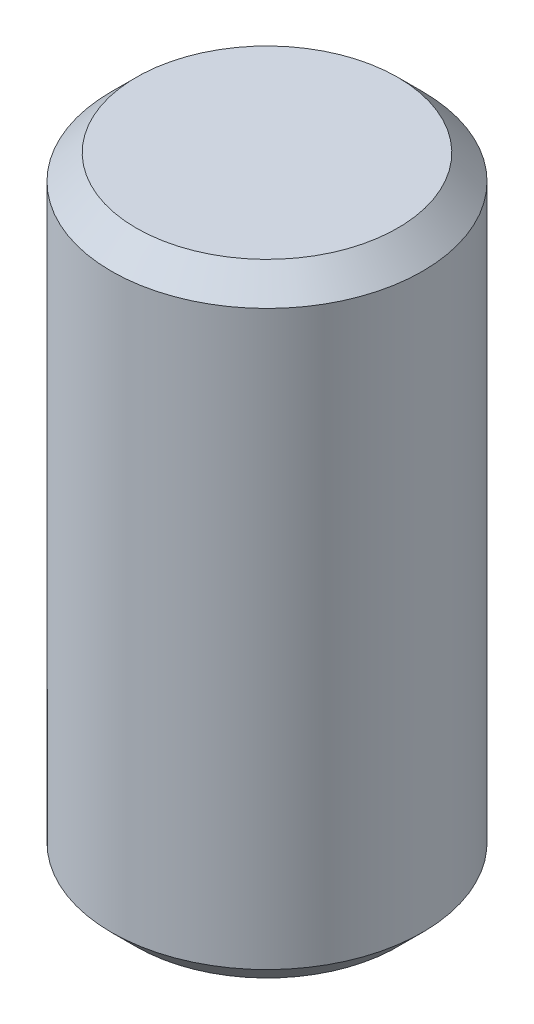
ISO-10303-21;
HEADER;
FILE_DESCRIPTION(('STEP AP214'),'2;1');
FILE_NAME('part.step','',(''),(''),'','','');
FILE_SCHEMA(('AUTOMOTIVE_DESIGN { 1 0 10303 214 1 1 1 1 }'));
ENDSEC;
DATA;
#1=APPLICATION_CONTEXT('core data for automotive mechanical design processes');
#2=APPLICATION_PROTOCOL_DEFINITION('international standard','automotive_design',2000,#1);
#3=PRODUCT_CONTEXT('',#1,'mechanical');
#4=PRODUCT('Part','Part','',(#3));
#5=PRODUCT_RELATED_PRODUCT_CATEGORY('part','',(#4));
#6=PRODUCT_DEFINITION_FORMATION('','',#4);
#7=PRODUCT_DEFINITION_CONTEXT('part definition',#1,'design');
#8=PRODUCT_DEFINITION('design','',#6,#7);
#9=PRODUCT_DEFINITION_SHAPE('','',#8);
#10=(LENGTH_UNIT() NAMED_UNIT(*) SI_UNIT(.MILLI.,.METRE.));
#11=(NAMED_UNIT(*) PLANE_ANGLE_UNIT() SI_UNIT($,.RADIAN.));
#12=(NAMED_UNIT(*) SI_UNIT($,.STERADIAN.) SOLID_ANGLE_UNIT());
#13=UNCERTAINTY_MEASURE_WITH_UNIT(LENGTH_MEASURE(1.E-05),#10,'distance_accuracy_value','');
#14=(GEOMETRIC_REPRESENTATION_CONTEXT(3) GLOBAL_UNCERTAINTY_ASSIGNED_CONTEXT((#13)) GLOBAL_UNIT_ASSIGNED_CONTEXT((#10,
#11,#12)) REPRESENTATION_CONTEXT('',''));
#15=CARTESIAN_POINT('',(0.,0.,0.));
#16=DIRECTION('',(0.,0.,1.));
#17=DIRECTION('',(1.,0.,0.));
#18=AXIS2_PLACEMENT_3D('',#15,#16,#17);
#19=CARTESIAN_POINT('',(0.,-6.35,0.));
#20=DIRECTION('',(0.,1.,0.));
#21=DIRECTION('',(0.,0.,1.));
#22=AXIS2_PLACEMENT_3D('',#19,#20,#21);
#23=PLANE('',#22);
#24=CARTESIAN_POINT('',(0.,-6.35,0.));
#25=DIRECTION('',(0.,1.,0.));
#26=DIRECTION('',(0.,0.,1.));
#27=AXIS2_PLACEMENT_3D('',#24,#25,#26);
#28=CIRCLE('',#27,2.667);
#29=CARTESIAN_POINT('',(0.,-6.35,2.667));
#30=VERTEX_POINT('',#29);
#31=EDGE_CURVE('E38',#30,#30,#28,.F.);
#32=ORIENTED_EDGE('',*,*,#31,.T.);
#33=EDGE_LOOP('',(#32));
#34=FACE_BOUND('',#33,.T.);
#35=ADVANCED_FACE('F31',(#34),#23,.F.);
#36=CARTESIAN_POINT('',(0.,6.08020788678209,0.));
#37=DIRECTION('',(0.,1.,0.));
#38=DIRECTION('',(0.,0.,1.));
#39=AXIS2_PLACEMENT_3D('',#36,#37,#38);
#40=CYLINDRICAL_SURFACE('',#39,3.175);
#41=CARTESIAN_POINT('',(0.,-5.842,0.));
#42=DIRECTION('',(0.,1.,0.));
#43=DIRECTION('',(0.,0.,1.));
#44=AXIS2_PLACEMENT_3D('',#41,#42,#43);
#45=CIRCLE('',#44,3.175);
#46=CARTESIAN_POINT('',(0.,-5.842,3.175));
#47=VERTEX_POINT('',#46);
#48=EDGE_CURVE('E42',#47,#47,#45,.T.);
#49=ORIENTED_EDGE('',*,*,#48,.T.);
#50=EDGE_LOOP('',(#49));
#51=FACE_BOUND('',#50,.T.);
#52=CARTESIAN_POINT('',(0.,5.842,0.));
#53=DIRECTION('',(0.,-1.,0.));
#54=DIRECTION('',(0.,0.,-1.));
#55=AXIS2_PLACEMENT_3D('',#52,#53,#54);
#56=CIRCLE('',#55,3.175);
#57=CARTESIAN_POINT('',(0.,5.842,-3.175));
#58=VERTEX_POINT('',#57);
#59=EDGE_CURVE('E46',#58,#58,#56,.T.);
#60=ORIENTED_EDGE('',*,*,#59,.T.);
#61=EDGE_LOOP('',(#60));
#62=FACE_BOUND('',#61,.T.);
#63=ADVANCED_FACE('F52',(#51,#62),#40,.T.);
#64=CARTESIAN_POINT('',(3.175,6.35,0.));
#65=DIRECTION('',(0.,-1.,0.));
#66=DIRECTION('',(0.,0.,-1.));
#67=AXIS2_PLACEMENT_3D('',#64,#65,#66);
#68=PLANE('',#67);
#69=CARTESIAN_POINT('',(0.,6.35,0.));
#70=DIRECTION('',(0.,-1.,0.));
#71=DIRECTION('',(0.,0.,-1.));
#72=AXIS2_PLACEMENT_3D('',#69,#70,#71);
#73=CIRCLE('',#72,2.667);
#74=CARTESIAN_POINT('',(0.,6.35,-2.667));
#75=VERTEX_POINT('',#74);
#76=EDGE_CURVE('E10',#75,#75,#73,.F.);
#77=ORIENTED_EDGE('',*,*,#76,.T.);
#78=EDGE_LOOP('',(#77));
#79=FACE_BOUND('',#78,.T.);
#80=ADVANCED_FACE('F60',(#79),#68,.F.);
#81=CARTESIAN_POINT('',(0.,-5.842,0.));
#82=DIRECTION('',(0.,1.,0.));
#83=DIRECTION('',(0.,0.,1.));
#84=AXIS2_PLACEMENT_3D('',#81,#82,#83);
#85=CONICAL_SURFACE('',#84,3.175,0.785398163397449);
#86=ORIENTED_EDGE('',*,*,#31,.F.);
#87=EDGE_LOOP('',(#86));
#88=FACE_BOUND('',#87,.T.);
#89=ORIENTED_EDGE('',*,*,#48,.F.);
#90=EDGE_LOOP('',(#89));
#91=FACE_BOUND('',#90,.T.);
#92=ADVANCED_FACE('F56',(#88,#91),#85,.T.);
#93=CARTESIAN_POINT('',(0.,6.35,0.));
#94=DIRECTION('',(0.,-1.,0.));
#95=DIRECTION('',(0.,0.,-1.));
#96=AXIS2_PLACEMENT_3D('',#93,#94,#95);
#97=CONICAL_SURFACE('',#96,2.667,0.785398163397445);
#98=ORIENTED_EDGE('',*,*,#59,.F.);
#99=EDGE_LOOP('',(#98));
#100=FACE_BOUND('',#99,.T.);
#101=ORIENTED_EDGE('',*,*,#76,.F.);
#102=EDGE_LOOP('',(#101));
#103=FACE_BOUND('',#102,.T.);
#104=ADVANCED_FACE('F33',(#100,#103),#97,.T.);
#105=CLOSED_SHELL('',(#35,#63,#80,#92,#104));
#106=MANIFOLD_SOLID_BREP('B2',#105);
#107=ADVANCED_BREP_SHAPE_REPRESENTATION('',(#18,#106),#14);
#108=SHAPE_DEFINITION_REPRESENTATION(#9,#107);
ENDSEC;
END-ISO-10303-21;
